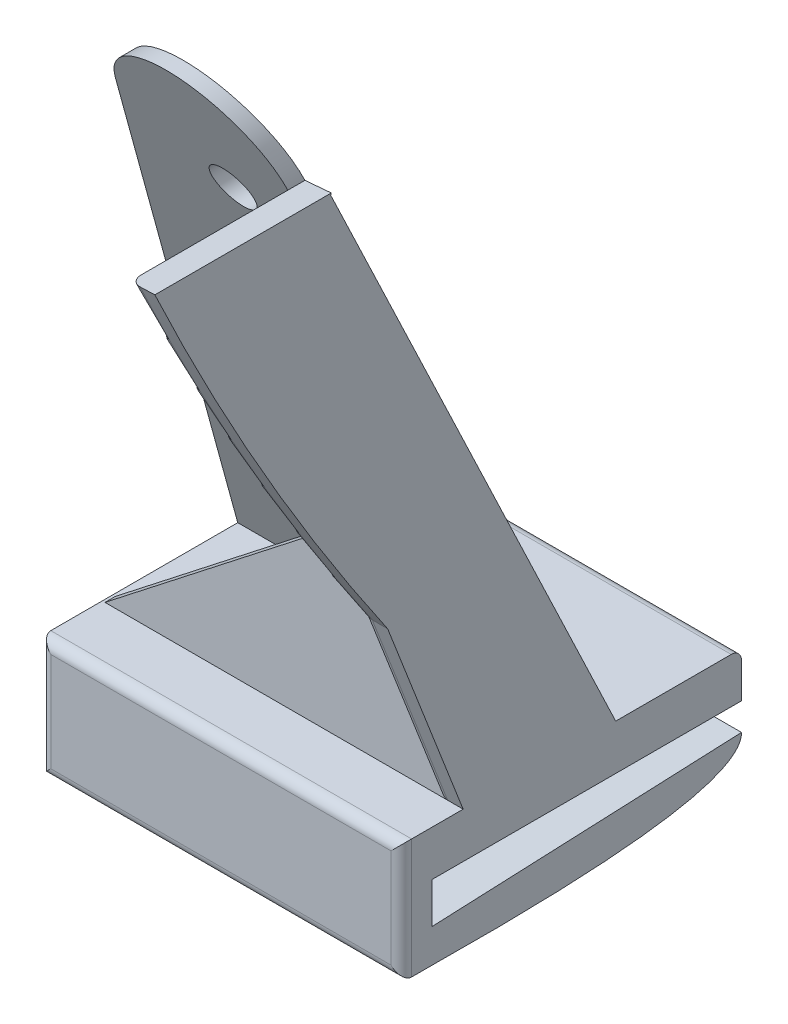
ISO-10303-21;
HEADER;
FILE_DESCRIPTION(('STEP AP214'),'2;1');
FILE_NAME('part.step','',(''),(''),'','','');
FILE_SCHEMA(('AUTOMOTIVE_DESIGN { 1 0 10303 214 1 1 1 1 }'));
ENDSEC;
DATA;
#1=APPLICATION_CONTEXT('core data for automotive mechanical design processes');
#2=APPLICATION_PROTOCOL_DEFINITION('international standard','automotive_design',2000,#1);
#3=PRODUCT_CONTEXT('',#1,'mechanical');
#4=PRODUCT('Part','Part','',(#3));
#5=PRODUCT_RELATED_PRODUCT_CATEGORY('part','',(#4));
#6=PRODUCT_DEFINITION_FORMATION('','',#4);
#7=PRODUCT_DEFINITION_CONTEXT('part definition',#1,'design');
#8=PRODUCT_DEFINITION('design','',#6,#7);
#9=PRODUCT_DEFINITION_SHAPE('','',#8);
#10=(LENGTH_UNIT() NAMED_UNIT(*) SI_UNIT(.MILLI.,.METRE.));
#11=(NAMED_UNIT(*) PLANE_ANGLE_UNIT() SI_UNIT($,.RADIAN.));
#12=(NAMED_UNIT(*) SI_UNIT($,.STERADIAN.) SOLID_ANGLE_UNIT());
#13=UNCERTAINTY_MEASURE_WITH_UNIT(LENGTH_MEASURE(1.E-05),#10,'distance_accuracy_value','');
#14=(GEOMETRIC_REPRESENTATION_CONTEXT(3) GLOBAL_UNCERTAINTY_ASSIGNED_CONTEXT((#13)) GLOBAL_UNIT_ASSIGNED_CONTEXT((#10,
#11,#12)) REPRESENTATION_CONTEXT('',''));
#15=CARTESIAN_POINT('',(0.,0.,0.));
#16=DIRECTION('',(0.,0.,1.));
#17=DIRECTION('',(1.,0.,0.));
#18=AXIS2_PLACEMENT_3D('',#15,#16,#17);
#19=CARTESIAN_POINT('',(35.,12.,3.));
#20=DIRECTION('',(-1.,0.,0.));
#21=DIRECTION('',(0.,0.,1.));
#22=AXIS2_PLACEMENT_3D('',#19,#20,#21);
#23=PLANE('',#22);
#24=DIRECTION('',(0.,1.,0.));
#25=VECTOR('',#24,1.);
#26=CARTESIAN_POINT('',(35.,12.,-30.));
#27=LINE('',#26,#25);
#28=CARTESIAN_POINT('',(35.,7.2,-30.));
#29=VERTEX_POINT('',#28);
#30=CARTESIAN_POINT('',(35.,10.6,-30.));
#31=VERTEX_POINT('',#30);
#32=EDGE_CURVE('E514',#29,#31,#27,.T.);
#33=ORIENTED_EDGE('',*,*,#32,.T.);
#34=CARTESIAN_POINT('',(35.,10.6,-29.));
#35=DIRECTION('',(-1.,0.,0.));
#36=DIRECTION('',(0.,0.,1.));
#37=AXIS2_PLACEMENT_3D('',#34,#35,#36);
#38=CIRCLE('',#37,1.);
#39=CARTESIAN_POINT('',(35.,11.6,-29.));
#40=VERTEX_POINT('',#39);
#41=EDGE_CURVE('E58',#31,#40,#38,.F.);
#42=ORIENTED_EDGE('',*,*,#41,.T.);
#43=DIRECTION('',(0.,0.,1.));
#44=VECTOR('',#43,1.);
#45=CARTESIAN_POINT('',(35.,11.6,3.));
#46=LINE('',#45,#44);
#47=CARTESIAN_POINT('',(35.,11.6,-17.7987012207227));
#48=VERTEX_POINT('',#47);
#49=EDGE_CURVE('E222',#40,#48,#46,.T.);
#50=ORIENTED_EDGE('',*,*,#49,.T.);
#51=DIRECTION('',(0.,-0.902694313973757,-0.430282436917251));
#52=VECTOR('',#51,1.);
#53=CARTESIAN_POINT('',(35.,20.0044393379013,-13.7926023860949));
#54=LINE('',#53,#52);
#55=CARTESIAN_POINT('',(35.,69.5995035208979,9.84760974926995));
#56=VERTEX_POINT('',#55);
#57=EDGE_CURVE('E497',#56,#48,#54,.T.);
#58=ORIENTED_EDGE('',*,*,#57,.F.);
#59=DIRECTION('',(0.,-0.94274645692126,0.333510296636267));
#60=VECTOR('',#59,1.);
#61=CARTESIAN_POINT('',(35.,20.5597376453932,27.1961415247425));
#62=LINE('',#61,#60);
#63=CARTESIAN_POINT('',(35.0000000000001,69.7618447677817,9.7901791675828));
#64=VERTEX_POINT('',#63);
#65=EDGE_CURVE('E275',#64,#56,#62,.T.);
#66=ORIENTED_EDGE('',*,*,#65,.F.);
#67=DIRECTION('',(0.,0.,1.));
#68=VECTOR('',#67,1.);
#69=CARTESIAN_POINT('',(35.,69.7618447677817,3.));
#70=LINE('',#69,#68);
#71=CARTESIAN_POINT('',(35.0000000000001,69.7618447677817,26.902975673547));
#72=VERTEX_POINT('',#71);
#73=EDGE_CURVE('E403',#64,#72,#70,.T.);
#74=ORIENTED_EDGE('',*,*,#73,.T.);
#75=CARTESIAN_POINT('',(35.,186.497951372783,-222.090360411389));
#76=DIRECTION('',(-1.,0.,0.));
#77=DIRECTION('',(0.,0.,-1.));
#78=AXIS2_PLACEMENT_3D('',#75,#76,#77);
#79=CIRCLE('',#78,275.);
#80=CARTESIAN_POINT('',(35.,30.4120068557558,4.32116297959823));
#81=VERTEX_POINT('',#80);
#82=EDGE_CURVE('E378',#81,#72,#79,.T.);
#83=ORIENTED_EDGE('',*,*,#82,.F.);
#84=DIRECTION('',(0.,-0.931914570803609,-0.362677863570311));
#85=VECTOR('',#84,1.);
#86=CARTESIAN_POINT('',(35.,13.975294620325,-2.07559468942881));
#87=LINE('',#86,#85);
#88=CARTESIAN_POINT('',(35.,11.6,-3.));
#89=VERTEX_POINT('',#88);
#90=EDGE_CURVE('E376',#81,#89,#87,.T.);
#91=ORIENTED_EDGE('',*,*,#90,.T.);
#92=DIRECTION('',(0.,0.,1.));
#93=VECTOR('',#92,1.);
#94=CARTESIAN_POINT('',(35.,11.6,3.));
#95=LINE('',#94,#93);
#96=CARTESIAN_POINT('',(35.,11.6,2.));
#97=VERTEX_POINT('',#96);
#98=EDGE_CURVE('E469',#89,#97,#95,.T.);
#99=ORIENTED_EDGE('',*,*,#98,.T.);
#100=DIRECTION('',(0.,1.,0.));
#101=VECTOR('',#100,1.);
#102=CARTESIAN_POINT('',(35.,12.,2.));
#103=LINE('',#102,#101);
#104=CARTESIAN_POINT('',(35.,0.,2.));
#105=VERTEX_POINT('',#104);
#106=EDGE_CURVE('E331',#97,#105,#103,.F.);
#107=ORIENTED_EDGE('',*,*,#106,.T.);
#108=DIRECTION('',(0.,0.,-1.));
#109=VECTOR('',#108,1.);
#110=CARTESIAN_POINT('',(35.,0.,3.));
#111=LINE('',#110,#109);
#112=CARTESIAN_POINT('',(35.,0.,0.));
#113=VERTEX_POINT('',#112);
#114=EDGE_CURVE('E224',#105,#113,#111,.T.);
#115=ORIENTED_EDGE('',*,*,#114,.T.);
#116=CARTESIAN_POINT('',(35.,0.,0.));
#117=CARTESIAN_POINT('',(35.,-0.376378600084011,-30.0529531093992));
#118=CARTESIAN_POINT('',(35.,4.55,-30.));
#119=B_SPLINE_CURVE_WITH_KNOTS('',2,(#116,#117,#118),.UNSPECIFIED.,.F.,.F.,(3,3),(0.,1.),.UNSPECIFIED.);
#120=CARTESIAN_POINT('',(35.,4.55,-30.));
#121=VERTEX_POINT('',#120);
#122=EDGE_CURVE('E200',#113,#121,#119,.T.);
#123=ORIENTED_EDGE('',*,*,#122,.T.);
#124=DIRECTION('',(0.,-0.0432927053569365,0.999062431313918));
#125=VECTOR('',#124,1.);
#126=CARTESIAN_POINT('',(35.,3.25,0.));
#127=LINE('',#126,#125);
#128=CARTESIAN_POINT('',(35.,3.25,0.));
#129=VERTEX_POINT('',#128);
#130=EDGE_CURVE('E247',#121,#129,#127,.T.);
#131=ORIENTED_EDGE('',*,*,#130,.T.);
#132=DIRECTION('',(0.,1.,0.));
#133=VECTOR('',#132,1.);
#134=CARTESIAN_POINT('',(35.,12.,0.));
#135=LINE('',#134,#133);
#136=CARTESIAN_POINT('',(35.,7.2,0.));
#137=VERTEX_POINT('',#136);
#138=EDGE_CURVE('E831',#129,#137,#135,.T.);
#139=ORIENTED_EDGE('',*,*,#138,.T.);
#140=DIRECTION('',(0.,0.,-1.));
#141=VECTOR('',#140,1.);
#142=CARTESIAN_POINT('',(35.,7.2,0.));
#143=LINE('',#142,#141);
#144=EDGE_CURVE('E237',#137,#29,#143,.T.);
#145=ORIENTED_EDGE('',*,*,#144,.T.);
#146=EDGE_LOOP('',(#33,#42,#50,#58,#66,#74,#83,#91,#99,#107,#115,#123,#131,#139,#145));
#147=FACE_BOUND('',#146,.T.);
#148=ADVANCED_FACE('F36',(#147),#23,.F.);
#149=CARTESIAN_POINT('',(32.5,69.5995035208979,0.));
#150=DIRECTION('',(0.0648000197714473,-0.997898270084491,0.));
#151=DIRECTION('',(0.997898270084491,0.0648000197714473,0.));
#152=AXIS2_PLACEMENT_3D('',#149,#150,#151);
#153=PLANE('',#152);
#154=DIRECTION('',(0.997636171848008,0.0647830000296407,-0.0229179302645497));
#155=VECTOR('',#154,1.);
#156=CARTESIAN_POINT('',(32.7251533486157,69.6141241910397,9.84243747415803));
#157=LINE('',#156,#155);
#158=CARTESIAN_POINT('',(32.5,69.5995035208979,9.84760974926995));
#159=VERTEX_POINT('',#158);
#160=EDGE_CURVE('E502',#159,#64,#157,.T.);
#161=ORIENTED_EDGE('',*,*,#160,.F.);
#162=DIRECTION('',(0.,0.,1.));
#163=VECTOR('',#162,1.);
#164=CARTESIAN_POINT('',(32.5,69.5995035208979,0.));
#165=LINE('',#164,#163);
#166=CARTESIAN_POINT('',(32.5,69.5995035208979,11.5093018379205));
#167=VERTEX_POINT('',#166);
#168=EDGE_CURVE('E453',#159,#167,#165,.T.);
#169=ORIENTED_EDGE('',*,*,#168,.T.);
#170=CARTESIAN_POINT('',(32.5,69.5995035208979,25.7215700718309));
#171=VERTEX_POINT('',#170);
#172=EDGE_CURVE('E352',#167,#171,#165,.T.);
#173=ORIENTED_EDGE('',*,*,#172,.T.);
#174=CARTESIAN_POINT('',(32.5,69.5995035208979,25.7215700718309));
#175=CARTESIAN_POINT('',(32.4999809224686,69.5995022820698,25.7900385837331));
#176=CARTESIAN_POINT('',(32.5057509576556,69.5998769679526,25.8585045692338));
#177=CARTESIAN_POINT('',(32.5285812655456,69.6013594882124,25.9936344856225));
#178=CARTESIAN_POINT('',(32.5456600003037,69.6024685214508,26.0602952839014));
#179=CARTESIAN_POINT('',(32.5908378849241,69.6054022150991,26.189838792116));
#180=CARTESIAN_POINT('',(32.6189468233881,69.6072275111466,26.2527180888926));
#181=CARTESIAN_POINT('',(32.6856717817598,69.6115603963227,26.3725816654304));
#182=CARTESIAN_POINT('',(32.7242800770288,69.6140674838404,26.4295702367705));
#183=CARTESIAN_POINT('',(32.8096209692292,69.6196092225803,26.5335702053055));
#184=CARTESIAN_POINT('',(32.8559968101591,69.6226207073171,26.5808744656594));
#185=CARTESIAN_POINT('',(32.9567550235203,69.6291635929134,26.6660607935826));
#186=CARTESIAN_POINT('',(33.0111367945895,69.6326949547227,26.7039435682686));
#187=CARTESIAN_POINT('',(33.1209388566987,69.6398251161919,26.7652912220209));
#188=CARTESIAN_POINT('',(33.1757985495179,69.6433875125663,26.7897651082781));
#189=CARTESIAN_POINT('',(33.2890606899914,69.65074235941,26.8279381357866));
#190=CARTESIAN_POINT('',(33.3474527574135,69.6545341358234,26.8416673384864));
#191=CARTESIAN_POINT('',(33.4220285328634,69.6593768255729,26.8516826110144));
#192=CARTESIAN_POINT('',(33.4375915517591,69.66038743353,26.8533662599938));
#193=CARTESIAN_POINT('',(33.468763205642,69.6624116115935,26.8559285792759));
#194=CARTESIAN_POINT('',(33.4843717557904,69.6634251761908,26.8568082860898));
#195=CARTESIAN_POINT('',(33.5,69.6644400196514,26.8572859420115));
#196=B_SPLINE_CURVE_WITH_KNOTS('',3,(#174,#175,#176,#177,#178,#179,#180,#181,#182,#183,#184,
#185,#186,#187,#188,#189,#190,#191,#192,#193,#194,#195),.UNSPECIFIED.,.F.,.F.,(4,2,2,2,2,2,2,2,
2,2,4),(0.,0.205165865480211,0.410667503724113,0.61635192549021,0.821885427599768,
1.01975245137075,1.21760462002066,1.39716917414618,1.57622952893574,1.62327551534842,
1.67026076010732),.UNSPECIFIED.);
#197=CARTESIAN_POINT('',(33.4999999999994,69.6644400196514,26.8572859420116));
#198=VERTEX_POINT('',#197);
#199=EDGE_CURVE('E256',#171,#198,#196,.T.);
#200=ORIENTED_EDGE('',*,*,#199,.T.);
#201=CARTESIAN_POINT('',(1832.6963471369,186.497951372783,-222.090360411389));
#202=DIRECTION('',(0.0648000197714473,-0.997898270084491,0.));
#203=DIRECTION('',(0.997898270084491,0.0648000197714473,0.));
#204=AXIS2_PLACEMENT_3D('',#201,#202,#203);
#205=ELLIPSE('',#204,4243.8258656392,275.);
#206=EDGE_CURVE('E367',#72,#198,#205,.T.);
#207=ORIENTED_EDGE('',*,*,#206,.F.);
#208=ORIENTED_EDGE('',*,*,#73,.F.);
#209=EDGE_LOOP('',(#161,#169,#173,#200,#207,#208));
#210=FACE_BOUND('',#209,.T.);
#211=ADVANCED_FACE('F294',(#210),#153,.F.);
#212=CARTESIAN_POINT('',(0.,0.,3.));
#213=DIRECTION('',(0.,0.,-1.));
#214=DIRECTION('',(-1.,0.,0.));
#215=AXIS2_PLACEMENT_3D('',#212,#213,#214);
#216=PLANE('',#215);
#217=DIRECTION('',(-1.,0.,0.));
#218=VECTOR('',#217,1.);
#219=CARTESIAN_POINT('',(0.,10.6,3.));
#220=LINE('',#219,#218);
#221=CARTESIAN_POINT('',(34.,10.6,3.));
#222=VERTEX_POINT('',#221);
#223=CARTESIAN_POINT('',(1.,10.6,3.));
#224=VERTEX_POINT('',#223);
#225=EDGE_CURVE('E416',#222,#224,#220,.T.);
#226=ORIENTED_EDGE('',*,*,#225,.T.);
#227=DIRECTION('',(0.,-1.,0.));
#228=VECTOR('',#227,1.);
#229=CARTESIAN_POINT('',(1.,0.,3.));
#230=LINE('',#229,#228);
#231=CARTESIAN_POINT('',(1.,1.,3.));
#232=VERTEX_POINT('',#231);
#233=EDGE_CURVE('E343',#224,#232,#230,.T.);
#234=ORIENTED_EDGE('',*,*,#233,.T.);
#235=DIRECTION('',(1.,0.,0.));
#236=VECTOR('',#235,1.);
#237=CARTESIAN_POINT('',(0.,1.,3.));
#238=LINE('',#237,#236);
#239=CARTESIAN_POINT('',(34.,1.,3.));
#240=VERTEX_POINT('',#239);
#241=EDGE_CURVE('E419',#232,#240,#238,.T.);
#242=ORIENTED_EDGE('',*,*,#241,.T.);
#243=DIRECTION('',(0.,1.,0.));
#244=VECTOR('',#243,1.);
#245=CARTESIAN_POINT('',(34.,0.,3.));
#246=LINE('',#245,#244);
#247=EDGE_CURVE('E333',#240,#222,#246,.T.);
#248=ORIENTED_EDGE('',*,*,#247,.T.);
#249=EDGE_LOOP('',(#226,#234,#242,#248));
#250=FACE_BOUND('',#249,.T.);
#251=ADVANCED_FACE('F299',(#250),#216,.F.);
#252=CARTESIAN_POINT('',(0.,11.6,0.));
#253=DIRECTION('',(0.,1.,0.));
#254=DIRECTION('',(0.,0.,1.));
#255=AXIS2_PLACEMENT_3D('',#252,#253,#254);
#256=PLANE('',#255);
#257=DIRECTION('',(0.,0.,1.));
#258=VECTOR('',#257,1.);
#259=CARTESIAN_POINT('',(0.,11.6,0.));
#260=LINE('',#259,#258);
#261=CARTESIAN_POINT('',(0.,11.6,-16.1370091320722));
#262=VERTEX_POINT('',#261);
#263=CARTESIAN_POINT('',(0.,11.6,2.));
#264=VERTEX_POINT('',#263);
#265=EDGE_CURVE('E429',#262,#264,#260,.T.);
#266=ORIENTED_EDGE('',*,*,#265,.T.);
#267=DIRECTION('',(-1.,0.,0.));
#268=VECTOR('',#267,1.);
#269=CARTESIAN_POINT('',(35.,11.6,2.));
#270=LINE('',#269,#268);
#271=EDGE_CURVE('E341',#264,#97,#270,.F.);
#272=ORIENTED_EDGE('',*,*,#271,.T.);
#273=ORIENTED_EDGE('',*,*,#98,.F.);
#274=DIRECTION('',(-1.,0.,0.));
#275=VECTOR('',#274,1.);
#276=CARTESIAN_POINT('',(42.5,11.6,-3.));
#277=LINE('',#276,#275);
#278=CARTESIAN_POINT('',(33.5,11.6,-3.));
#279=VERTEX_POINT('',#278);
#280=EDGE_CURVE('E466',#89,#279,#277,.T.);
#281=ORIENTED_EDGE('',*,*,#280,.T.);
#282=DIRECTION('',(1.,0.,0.));
#283=VECTOR('',#282,1.);
#284=CARTESIAN_POINT('',(0.,11.6,-3.));
#285=LINE('',#284,#283);
#286=CARTESIAN_POINT('',(0.256151202890215,11.6,-3.));
#287=VERTEX_POINT('',#286);
#288=EDGE_CURVE('E477',#287,#279,#285,.T.);
#289=ORIENTED_EDGE('',*,*,#288,.F.);
#290=DIRECTION('',(0.,0.,1.));
#291=VECTOR('',#290,1.);
#292=CARTESIAN_POINT('',(0.256151202890223,11.6,0.));
#293=LINE('',#292,#291);
#294=CARTESIAN_POINT('',(0.256151202890223,11.6,-4.));
#295=VERTEX_POINT('',#294);
#296=EDGE_CURVE('E481',#295,#287,#293,.T.);
#297=ORIENTED_EDGE('',*,*,#296,.F.);
#298=DIRECTION('',(1.,0.,0.));
#299=VECTOR('',#298,1.);
#300=CARTESIAN_POINT('',(0.,11.6,-4.));
#301=LINE('',#300,#299);
#302=CARTESIAN_POINT('',(32.5,11.6,-4.));
#303=VERTEX_POINT('',#302);
#304=EDGE_CURVE('E479',#295,#303,#301,.T.);
#305=ORIENTED_EDGE('',*,*,#304,.T.);
#306=DIRECTION('',(0.,0.,1.));
#307=VECTOR('',#306,1.);
#308=CARTESIAN_POINT('',(32.5,11.6,0.));
#309=LINE('',#308,#307);
#310=CARTESIAN_POINT('',(32.5,11.6,-16.1370091320722));
#311=VERTEX_POINT('',#310);
#312=EDGE_CURVE('E379',#311,#303,#309,.T.);
#313=ORIENTED_EDGE('',*,*,#312,.F.);
#314=DIRECTION('',(-1.,0.,0.));
#315=VECTOR('',#314,1.);
#316=CARTESIAN_POINT('',(0.,11.6,-16.1370091320722));
#317=LINE('',#316,#315);
#318=EDGE_CURVE('E206',#311,#262,#317,.T.);
#319=ORIENTED_EDGE('',*,*,#318,.T.);
#320=EDGE_LOOP('',(#266,#272,#273,#281,#289,#297,#305,#313,#319));
#321=FACE_BOUND('',#320,.T.);
#322=ADVANCED_FACE('F432',(#321),#256,.T.);
#323=CARTESIAN_POINT('',(32.5,128.,105.));
#324=DIRECTION('',(-1.,0.,0.));
#325=DIRECTION('',(0.,0.,1.));
#326=AXIS2_PLACEMENT_3D('',#323,#324,#325);
#327=PLANE('',#326);
#328=DIRECTION('',(0.,1.,0.));
#329=VECTOR('',#328,1.);
#330=CARTESIAN_POINT('',(32.5,128.,-3.));
#331=LINE('',#330,#329);
#332=CARTESIAN_POINT('',(32.5,14.3572678137995,-3.));
#333=VERTEX_POINT('',#332);
#334=CARTESIAN_POINT('',(32.5,36.7756372277729,-3.));
#335=VERTEX_POINT('',#334);
#336=EDGE_CURVE('E387',#333,#335,#331,.T.);
#337=ORIENTED_EDGE('',*,*,#336,.F.);
#338=DIRECTION('',(0.,-0.931914570803609,-0.362677863570311));
#339=VECTOR('',#338,1.);
#340=CARTESIAN_POINT('',(32.5,30.7746847193261,3.38924840879462));
#341=LINE('',#340,#339);
#342=CARTESIAN_POINT('',(32.5,30.8835778877866,3.43162690885454));
#343=VERTEX_POINT('',#342);
#344=EDGE_CURVE('E357',#333,#343,#341,.F.);
#345=ORIENTED_EDGE('',*,*,#344,.T.);
#346=CARTESIAN_POINT('',(32.5,186.497951372783,-222.090360411389));
#347=DIRECTION('',(-1.,0.,0.));
#348=DIRECTION('',(0.,0.,1.));
#349=AXIS2_PLACEMENT_3D('',#346,#347,#348);
#350=CIRCLE('',#349,274.);
#351=EDGE_CURVE('E355',#343,#171,#350,.T.);
#352=ORIENTED_EDGE('',*,*,#351,.T.);
#353=ORIENTED_EDGE('',*,*,#172,.F.);
#354=DIRECTION('',(0.,0.902694313973756,0.430282436917252));
#355=VECTOR('',#354,1.);
#356=CARTESIAN_POINT('',(32.4999999999999,128.,39.3467519616354));
#357=LINE('',#356,#355);
#358=EDGE_CURVE('E488',#311,#167,#357,.T.);
#359=ORIENTED_EDGE('',*,*,#358,.F.);
#360=ORIENTED_EDGE('',*,*,#312,.T.);
#361=DIRECTION('',(0.,1.,0.));
#362=VECTOR('',#361,1.);
#363=CARTESIAN_POINT('',(32.5,128.,-4.));
#364=LINE('',#363,#362);
#365=CARTESIAN_POINT('',(32.5,36.7756372277729,-4.));
#366=VERTEX_POINT('',#365);
#367=EDGE_CURVE('E392',#303,#366,#364,.T.);
#368=ORIENTED_EDGE('',*,*,#367,.T.);
#369=DIRECTION('',(0.,0.,1.));
#370=VECTOR('',#369,1.);
#371=CARTESIAN_POINT('',(32.5,36.7756372277729,-4.));
#372=LINE('',#371,#370);
#373=EDGE_CURVE('E389',#366,#335,#372,.T.);
#374=ORIENTED_EDGE('',*,*,#373,.T.);
#375=EDGE_LOOP('',(#337,#345,#352,#353,#359,#360,#368,#374));
#376=FACE_BOUND('',#375,.T.);
#377=ADVANCED_FACE('F303',(#376),#327,.T.);
#378=CARTESIAN_POINT('',(0.,0.,3.));
#379=DIRECTION('',(1.,0.,0.));
#380=DIRECTION('',(0.,0.,-1.));
#381=AXIS2_PLACEMENT_3D('',#378,#379,#380);
#382=PLANE('',#381);
#383=DIRECTION('',(0.,0.,1.));
#384=VECTOR('',#383,1.);
#385=CARTESIAN_POINT('',(0.,10.6,-44.));
#386=LINE('',#385,#384);
#387=CARTESIAN_POINT('',(0.,10.6,-18.2753658349298));
#388=VERTEX_POINT('',#387);
#389=CARTESIAN_POINT('',(0.,10.6,-30.));
#390=VERTEX_POINT('',#389);
#391=EDGE_CURVE('E409',#388,#390,#386,.F.);
#392=ORIENTED_EDGE('',*,*,#391,.T.);
#393=DIRECTION('',(0.,1.,0.));
#394=VECTOR('',#393,1.);
#395=CARTESIAN_POINT('',(0.,4.55,-30.));
#396=LINE('',#395,#394);
#397=CARTESIAN_POINT('',(0.,7.2,-30.));
#398=VERTEX_POINT('',#397);
#399=EDGE_CURVE('E217',#398,#390,#396,.T.);
#400=ORIENTED_EDGE('',*,*,#399,.F.);
#401=DIRECTION('',(0.,0.,-1.));
#402=VECTOR('',#401,1.);
#403=CARTESIAN_POINT('',(0.,7.2,0.));
#404=LINE('',#403,#402);
#405=CARTESIAN_POINT('',(0.,7.2,0.));
#406=VERTEX_POINT('',#405);
#407=EDGE_CURVE('E436',#406,#398,#404,.T.);
#408=ORIENTED_EDGE('',*,*,#407,.F.);
#409=DIRECTION('',(0.,-1.,0.));
#410=VECTOR('',#409,1.);
#411=CARTESIAN_POINT('',(0.,0.,0.));
#412=LINE('',#411,#410);
#413=CARTESIAN_POINT('',(0.,3.25,0.));
#414=VERTEX_POINT('',#413);
#415=EDGE_CURVE('E233',#406,#414,#412,.T.);
#416=ORIENTED_EDGE('',*,*,#415,.T.);
#417=DIRECTION('',(0.,-0.0432927053569365,0.999062431313918));
#418=VECTOR('',#417,1.);
#419=CARTESIAN_POINT('',(0.,3.25,0.));
#420=LINE('',#419,#418);
#421=CARTESIAN_POINT('',(0.,4.55,-30.));
#422=VERTEX_POINT('',#421);
#423=EDGE_CURVE('E216',#422,#414,#420,.T.);
#424=ORIENTED_EDGE('',*,*,#423,.F.);
#425=CARTESIAN_POINT('',(0.,0.,0.));
#426=CARTESIAN_POINT('',(0.,-0.376378600084011,-30.0529531093992));
#427=CARTESIAN_POINT('',(0.,4.55,-30.));
#428=B_SPLINE_CURVE_WITH_KNOTS('',2,(#425,#426,#427),.UNSPECIFIED.,.F.,.F.,(3,3),(0.,1.),.UNSPECIFIED.);
#429=CARTESIAN_POINT('',(0.,0.,0.));
#430=VERTEX_POINT('',#429);
#431=EDGE_CURVE('E197',#430,#422,#428,.T.);
#432=ORIENTED_EDGE('',*,*,#431,.F.);
#433=DIRECTION('',(0.,0.,-1.));
#434=VECTOR('',#433,1.);
#435=CARTESIAN_POINT('',(0.,0.,3.));
#436=LINE('',#435,#434);
#437=CARTESIAN_POINT('',(0.,0.,2.));
#438=VERTEX_POINT('',#437);
#439=EDGE_CURVE('E205',#438,#430,#436,.T.);
#440=ORIENTED_EDGE('',*,*,#439,.F.);
#441=DIRECTION('',(0.,-1.,0.));
#442=VECTOR('',#441,1.);
#443=CARTESIAN_POINT('',(0.,0.,2.));
#444=LINE('',#443,#442);
#445=EDGE_CURVE('E339',#438,#264,#444,.F.);
#446=ORIENTED_EDGE('',*,*,#445,.T.);
#447=ORIENTED_EDGE('',*,*,#265,.F.);
#448=DIRECTION('',(0.,0.,-1.));
#449=VECTOR('',#448,1.);
#450=CARTESIAN_POINT('',(0.,11.6,105.));
#451=LINE('',#450,#449);
#452=CARTESIAN_POINT('',(0.,11.6,-17.7987012207227));
#453=VERTEX_POINT('',#452);
#454=EDGE_CURVE('E484',#262,#453,#451,.T.);
#455=ORIENTED_EDGE('',*,*,#454,.T.);
#456=DIRECTION('',(0.,-0.902694313973757,-0.430282436917252));
#457=VECTOR('',#456,1.);
#458=CARTESIAN_POINT('',(0.,10.2261550441347,-18.4535644965906));
#459=LINE('',#458,#457);
#460=EDGE_CURVE('E411',#453,#388,#459,.T.);
#461=ORIENTED_EDGE('',*,*,#460,.T.);
#462=EDGE_LOOP('',(#392,#400,#408,#416,#424,#432,#440,#446,#447,#455,#461));
#463=FACE_BOUND('',#462,.T.);
#464=ADVANCED_FACE('F212',(#463),#382,.F.);
#465=ORIENTED_EDGE('',*,*,#49,.F.);
#466=DIRECTION('',(1.,0.,0.));
#467=VECTOR('',#466,1.);
#468=CARTESIAN_POINT('',(1.,11.6,-29.));
#469=LINE('',#468,#467);
#470=CARTESIAN_POINT('',(1.,11.6,-29.));
#471=VERTEX_POINT('',#470);
#472=EDGE_CURVE('E44',#40,#471,#469,.F.);
#473=ORIENTED_EDGE('',*,*,#472,.T.);
#474=DIRECTION('',(0.,0.,1.));
#475=VECTOR('',#474,1.);
#476=CARTESIAN_POINT('',(1.,11.6,-17.7987012207227));
#477=LINE('',#476,#475);
#478=CARTESIAN_POINT('',(1.,11.6,-17.7987012207227));
#479=VERTEX_POINT('',#478);
#480=EDGE_CURVE('E407',#471,#479,#477,.T.);
#481=ORIENTED_EDGE('',*,*,#480,.T.);
#482=DIRECTION('',(1.,0.,0.));
#483=VECTOR('',#482,1.);
#484=CARTESIAN_POINT('',(-37.5,11.6,-17.7987012207227));
#485=LINE('',#484,#483);
#486=EDGE_CURVE('E489',#479,#48,#485,.T.);
#487=ORIENTED_EDGE('',*,*,#486,.T.);
#488=EDGE_LOOP('',(#465,#473,#481,#487));
#489=FACE_BOUND('',#488,.T.);
#490=ADVANCED_FACE('F493',(#489),#256,.T.);
#491=CARTESIAN_POINT('',(0.,0.,3.));
#492=DIRECTION('',(0.,1.,0.));
#493=DIRECTION('',(0.,0.,1.));
#494=AXIS2_PLACEMENT_3D('',#491,#492,#493);
#495=PLANE('',#494);
#496=ORIENTED_EDGE('',*,*,#114,.F.);
#497=DIRECTION('',(1.,0.,0.));
#498=VECTOR('',#497,1.);
#499=CARTESIAN_POINT('',(0.,0.,2.));
#500=LINE('',#499,#498);
#501=EDGE_CURVE('E221',#105,#438,#500,.F.);
#502=ORIENTED_EDGE('',*,*,#501,.T.);
#503=ORIENTED_EDGE('',*,*,#439,.T.);
#504=DIRECTION('',(1.,0.,0.));
#505=VECTOR('',#504,1.);
#506=CARTESIAN_POINT('',(0.,0.,0.));
#507=LINE('',#506,#505);
#508=EDGE_CURVE('E194',#430,#113,#507,.T.);
#509=ORIENTED_EDGE('',*,*,#508,.T.);
#510=EDGE_LOOP('',(#496,#502,#503,#509));
#511=FACE_BOUND('',#510,.T.);
#512=ADVANCED_FACE('F219',(#511),#495,.F.);
#513=CARTESIAN_POINT('',(0.,0.,0.));
#514=DIRECTION('',(0.,0.,-1.));
#515=DIRECTION('',(-1.,0.,0.));
#516=AXIS2_PLACEMENT_3D('',#513,#514,#515);
#517=PLANE('',#516);
#518=DIRECTION('',(1.,0.,0.));
#519=VECTOR('',#518,1.);
#520=CARTESIAN_POINT('',(0.,7.2,0.));
#521=LINE('',#520,#519);
#522=EDGE_CURVE('E236',#406,#137,#521,.T.);
#523=ORIENTED_EDGE('',*,*,#522,.T.);
#524=ORIENTED_EDGE('',*,*,#138,.F.);
#525=DIRECTION('',(1.,0.,0.));
#526=VECTOR('',#525,1.);
#527=CARTESIAN_POINT('',(0.,3.25,0.));
#528=LINE('',#527,#526);
#529=EDGE_CURVE('E246',#414,#129,#528,.T.);
#530=ORIENTED_EDGE('',*,*,#529,.F.);
#531=ORIENTED_EDGE('',*,*,#415,.F.);
#532=EDGE_LOOP('',(#523,#524,#530,#531));
#533=FACE_BOUND('',#532,.T.);
#534=ADVANCED_FACE('F567',(#533),#517,.T.);
#535=CARTESIAN_POINT('',(0.,3.25,0.));
#536=DIRECTION('',(0.,0.999062431313918,0.0432927053569365));
#537=DIRECTION('',(0.,-0.0432927053569365,0.999062431313918));
#538=AXIS2_PLACEMENT_3D('',#535,#536,#537);
#539=PLANE('',#538);
#540=DIRECTION('',(-1.,0.,0.));
#541=VECTOR('',#540,1.);
#542=CARTESIAN_POINT('',(100.,4.55,-30.));
#543=LINE('',#542,#541);
#544=EDGE_CURVE('E516',#121,#422,#543,.T.);
#545=ORIENTED_EDGE('',*,*,#544,.T.);
#546=ORIENTED_EDGE('',*,*,#423,.T.);
#547=ORIENTED_EDGE('',*,*,#529,.T.);
#548=ORIENTED_EDGE('',*,*,#130,.F.);
#549=EDGE_LOOP('',(#545,#546,#547,#548));
#550=FACE_BOUND('',#549,.T.);
#551=ADVANCED_FACE('F572',(#550),#539,.T.);
#552=CARTESIAN_POINT('',(0.,7.2,0.));
#553=DIRECTION('',(0.,-1.,0.));
#554=DIRECTION('',(0.,0.,-1.));
#555=AXIS2_PLACEMENT_3D('',#552,#553,#554);
#556=PLANE('',#555);
#557=DIRECTION('',(-1.,0.,0.));
#558=VECTOR('',#557,1.);
#559=CARTESIAN_POINT('',(0.,7.2,-30.));
#560=LINE('',#559,#558);
#561=EDGE_CURVE('E509',#29,#398,#560,.T.);
#562=ORIENTED_EDGE('',*,*,#561,.F.);
#563=ORIENTED_EDGE('',*,*,#144,.F.);
#564=ORIENTED_EDGE('',*,*,#522,.F.);
#565=ORIENTED_EDGE('',*,*,#407,.T.);
#566=EDGE_LOOP('',(#562,#563,#564,#565));
#567=FACE_BOUND('',#566,.T.);
#568=ADVANCED_FACE('F578',(#567),#556,.T.);
#569=CARTESIAN_POINT('',(-35.,186.497951372783,-222.090360411389));
#570=DIRECTION('',(1.,0.,0.));
#571=DIRECTION('',(0.,0.,-1.));
#572=AXIS2_PLACEMENT_3D('',#569,#570,#571);
#573=CYLINDRICAL_SURFACE('',#572,275.);
#574=ORIENTED_EDGE('',*,*,#206,.T.);
#575=CARTESIAN_POINT('',(33.5,186.497951372783,-222.090360411389));
#576=DIRECTION('',(-1.,0.,0.));
#577=DIRECTION('',(0.,0.,1.));
#578=AXIS2_PLACEMENT_3D('',#575,#576,#577);
#579=CIRCLE('',#578,275.);
#580=CARTESIAN_POINT('',(33.5,30.4120068557558,4.32116297959823));
#581=VERTEX_POINT('',#580);
#582=EDGE_CURVE('E261',#198,#581,#579,.F.);
#583=ORIENTED_EDGE('',*,*,#582,.T.);
#584=DIRECTION('',(1.,0.,0.));
#585=VECTOR('',#584,1.);
#586=CARTESIAN_POINT('',(-35.,30.4120068557558,4.32116297959823));
#587=LINE('',#586,#585);
#588=EDGE_CURVE('E364',#581,#81,#587,.T.);
#589=ORIENTED_EDGE('',*,*,#588,.T.);
#590=ORIENTED_EDGE('',*,*,#82,.T.);
#591=EDGE_LOOP('',(#574,#583,#589,#590));
#592=FACE_BOUND('',#591,.T.);
#593=ADVANCED_FACE('F362',(#592),#573,.T.);
#594=CARTESIAN_POINT('',(-37.5000000000001,128.,39.3467519616354));
#595=DIRECTION('',(0.,0.430282436917252,-0.902694313973756));
#596=DIRECTION('',(0.,0.902694313973756,0.430282436917252));
#597=AXIS2_PLACEMENT_3D('',#594,#595,#596);
#598=PLANE('',#597);
#599=CARTESIAN_POINT('',(25.,65.,9.31688126658744));
#600=DIRECTION('',(0.,0.430282436917252,-0.902694313973756));
#601=DIRECTION('',(0.,0.902694313973756,0.430282436917252));
#602=AXIS2_PLACEMENT_3D('',#599,#600,#601);
#603=ELLIPSE('',#602,2.32636892411073,2.1);
#604=CARTESIAN_POINT('',(25.,67.1,10.3178769564224));
#605=VERTEX_POINT('',#604);
#606=EDGE_CURVE('E402',#605,#605,#603,.T.);
#607=ORIENTED_EDGE('',*,*,#606,.T.);
#608=EDGE_LOOP('',(#607));
#609=FACE_BOUND('',#608,.T.);
#610=ORIENTED_EDGE('',*,*,#358,.T.);
#611=CARTESIAN_POINT('',(24.5,69.5995035208995,11.5093018379212));
#612=DIRECTION('',(0.,0.430282436917252,-0.902694313973756));
#613=DIRECTION('',(0.,0.902694313973756,0.430282436917252));
#614=AXIS2_PLACEMENT_3D('',#611,#612,#613);
#615=ELLIPSE('',#614,8.8623578061361,7.99999999999999);
#616=CARTESIAN_POINT('',(16.794708656675,71.7508950042146,12.5347940293241));
#617=VERTEX_POINT('',#616);
#618=EDGE_CURVE('E449',#167,#617,#615,.F.);
#619=ORIENTED_EDGE('',*,*,#618,.T.);
#620=DIRECTION('',(-0.244397810333895,-0.875320157626628,-0.417234145242803));
#621=VECTOR('',#620,1.);
#622=CARTESIAN_POINT('',(28.3188797212798,113.025156909445,32.2087741570641));
#623=LINE('',#622,#621);
#624=EDGE_CURVE('E486',#617,#262,#623,.T.);
#625=ORIENTED_EDGE('',*,*,#624,.T.);
#626=ORIENTED_EDGE('',*,*,#318,.F.);
#627=EDGE_LOOP('',(#610,#619,#625,#626));
#628=FACE_BOUND('',#627,.T.);
#629=ADVANCED_FACE('F559',(#609,#628),#598,.F.);
#630=CARTESIAN_POINT('',(-37.5000000000001,128.,37.6850598729848));
#631=DIRECTION('',(0.,-0.430282436917252,0.902694313973757));
#632=DIRECTION('',(0.,-0.902694313973757,-0.430282436917252));
#633=AXIS2_PLACEMENT_3D('',#630,#631,#632);
#634=PLANE('',#633);
#635=ORIENTED_EDGE('',*,*,#486,.F.);
#636=CARTESIAN_POINT('',(1.,10.6,-18.2753658349298));
#637=DIRECTION('',(0.,-0.430282436917252,0.902694313973757));
#638=DIRECTION('',(0.,-0.902694313973757,-0.430282436917252));
#639=AXIS2_PLACEMENT_3D('',#636,#637,#638);
#640=ELLIPSE('',#639,1.10779472576701,1.);
#641=EDGE_CURVE('E414',#479,#388,#640,.T.);
#642=ORIENTED_EDGE('',*,*,#641,.T.);
#643=ORIENTED_EDGE('',*,*,#460,.F.);
#644=DIRECTION('',(0.244397810333895,0.875320157626628,0.417234145242803));
#645=VECTOR('',#644,1.);
#646=CARTESIAN_POINT('',(28.3188797212798,113.025156909445,30.5470820684136));
#647=LINE('',#646,#645);
#648=CARTESIAN_POINT('',(16.794708656675,71.7508950042146,10.8731019406735));
#649=VERTEX_POINT('',#648);
#650=EDGE_CURVE('E393',#453,#649,#647,.T.);
#651=ORIENTED_EDGE('',*,*,#650,.T.);
#652=CARTESIAN_POINT('',(24.5,69.5995035208995,9.84760974927068));
#653=DIRECTION('',(0.,-0.430282436917252,0.902694313973757));
#654=DIRECTION('',(0.,0.902694313973757,0.430282436917252));
#655=AXIS2_PLACEMENT_3D('',#652,#653,#654);
#656=ELLIPSE('',#655,8.86235780613609,7.99999999999999);
#657=EDGE_CURVE('E456',#649,#159,#656,.F.);
#658=ORIENTED_EDGE('',*,*,#657,.T.);
#659=DIRECTION('',(1.,0.,0.));
#660=VECTOR('',#659,1.);
#661=CARTESIAN_POINT('',(-107.529096293076,69.5995035208979,9.84760974926995));
#662=LINE('',#661,#660);
#663=EDGE_CURVE('E501',#159,#56,#662,.T.);
#664=ORIENTED_EDGE('',*,*,#663,.T.);
#665=ORIENTED_EDGE('',*,*,#57,.T.);
#666=EDGE_LOOP('',(#635,#642,#643,#651,#658,#664,#665));
#667=FACE_BOUND('',#666,.T.);
#668=CARTESIAN_POINT('',(25.,65.,7.6551891779369));
#669=DIRECTION('',(0.,-0.430282436917252,0.902694313973757));
#670=DIRECTION('',(0.,0.902694313973757,0.430282436917252));
#671=AXIS2_PLACEMENT_3D('',#668,#669,#670);
#672=ELLIPSE('',#671,2.32636892411073,2.1);
#673=CARTESIAN_POINT('',(25.,67.1,8.65618486777183));
#674=VERTEX_POINT('',#673);
#675=EDGE_CURVE('E399',#674,#674,#672,.T.);
#676=ORIENTED_EDGE('',*,*,#675,.T.);
#677=EDGE_LOOP('',(#676));
#678=FACE_BOUND('',#677,.T.);
#679=ADVANCED_FACE('F498',(#667,#678),#634,.F.);
#680=CARTESIAN_POINT('',(32.4999999999999,128.,105.));
#681=DIRECTION('',(0.963161417915574,-0.268923935414571,0.));
#682=DIRECTION('',(0.268923935414571,0.963161417915574,0.));
#683=AXIS2_PLACEMENT_3D('',#680,#681,#682);
#684=PLANE('',#683);
#685=ORIENTED_EDGE('',*,*,#624,.F.);
#686=DIRECTION('',(0.,0.,-1.));
#687=VECTOR('',#686,1.);
#688=CARTESIAN_POINT('',(16.794708656675,71.7508950042146,105.));
#689=LINE('',#688,#687);
#690=EDGE_CURVE('E395',#617,#649,#689,.T.);
#691=ORIENTED_EDGE('',*,*,#690,.T.);
#692=ORIENTED_EDGE('',*,*,#650,.F.);
#693=ORIENTED_EDGE('',*,*,#454,.F.);
#694=EDGE_LOOP('',(#685,#691,#692,#693));
#695=FACE_BOUND('',#694,.T.);
#696=ADVANCED_FACE('F554',(#695),#684,.F.);
#697=CARTESIAN_POINT('',(32.5,36.7756372277729,-4.));
#698=DIRECTION('',(-0.615418296825304,0.788200685062277,0.));
#699=DIRECTION('',(-0.788200685062277,-0.615418296825304,0.));
#700=AXIS2_PLACEMENT_3D('',#697,#698,#699);
#701=PLANE('',#700);
#702=DIRECTION('',(-0.788200685062277,-0.615418296825304,0.));
#703=VECTOR('',#702,1.);
#704=CARTESIAN_POINT('',(32.5,36.7756372277729,-4.));
#705=LINE('',#704,#703);
#706=EDGE_CURVE('E472',#366,#295,#705,.T.);
#707=ORIENTED_EDGE('',*,*,#706,.T.);
#708=ORIENTED_EDGE('',*,*,#296,.T.);
#709=DIRECTION('',(-0.788200685062277,-0.615418296825304,0.));
#710=VECTOR('',#709,1.);
#711=CARTESIAN_POINT('',(32.5,36.7756372277729,-3.));
#712=LINE('',#711,#710);
#713=EDGE_CURVE('E471',#335,#287,#712,.T.);
#714=ORIENTED_EDGE('',*,*,#713,.F.);
#715=ORIENTED_EDGE('',*,*,#373,.F.);
#716=EDGE_LOOP('',(#707,#708,#714,#715));
#717=FACE_BOUND('',#716,.T.);
#718=ADVANCED_FACE('F548',(#717),#701,.T.);
#719=CARTESIAN_POINT('',(0.,0.,-4.));
#720=DIRECTION('',(0.,0.,1.));
#721=DIRECTION('',(1.,0.,0.));
#722=AXIS2_PLACEMENT_3D('',#719,#720,#721);
#723=PLANE('',#722);
#724=ORIENTED_EDGE('',*,*,#304,.F.);
#725=ORIENTED_EDGE('',*,*,#706,.F.);
#726=ORIENTED_EDGE('',*,*,#367,.F.);
#727=EDGE_LOOP('',(#724,#725,#726));
#728=FACE_BOUND('',#727,.T.);
#729=ADVANCED_FACE('F545',(#728),#723,.F.);
#730=CARTESIAN_POINT('',(0.,0.,-3.));
#731=DIRECTION('',(0.,0.,1.));
#732=DIRECTION('',(1.,0.,0.));
#733=AXIS2_PLACEMENT_3D('',#730,#731,#732);
#734=PLANE('',#733);
#735=ORIENTED_EDGE('',*,*,#713,.T.);
#736=ORIENTED_EDGE('',*,*,#288,.T.);
#737=CARTESIAN_POINT('',(33.5,14.3572678137995,-3.));
#738=DIRECTION('',(0.,0.,1.));
#739=DIRECTION('',(0.,1.,0.));
#740=AXIS2_PLACEMENT_3D('',#737,#738,#739);
#741=ELLIPSE('',#740,2.75726781379954,1.);
#742=EDGE_CURVE('E252',#279,#333,#741,.F.);
#743=ORIENTED_EDGE('',*,*,#742,.T.);
#744=ORIENTED_EDGE('',*,*,#336,.T.);
#745=EDGE_LOOP('',(#735,#736,#743,#744));
#746=FACE_BOUND('',#745,.T.);
#747=ADVANCED_FACE('F544',(#746),#734,.T.);
#748=CARTESIAN_POINT('',(42.5,11.6,-3.));
#749=DIRECTION('',(0.,0.362677863570311,-0.931914570803609));
#750=DIRECTION('',(0.,0.931914570803609,0.362677863570311));
#751=AXIS2_PLACEMENT_3D('',#748,#749,#750);
#752=PLANE('',#751);
#753=ORIENTED_EDGE('',*,*,#588,.F.);
#754=DIRECTION('',(0.,-0.931914570803609,-0.362677863570311));
#755=VECTOR('',#754,1.);
#756=CARTESIAN_POINT('',(33.5,11.6,-3.));
#757=LINE('',#756,#755);
#758=EDGE_CURVE('E348',#581,#279,#757,.T.);
#759=ORIENTED_EDGE('',*,*,#758,.T.);
#760=ORIENTED_EDGE('',*,*,#280,.F.);
#761=ORIENTED_EDGE('',*,*,#90,.F.);
#762=EDGE_LOOP('',(#753,#759,#760,#761));
#763=FACE_BOUND('',#762,.T.);
#764=ADVANCED_FACE('F371',(#763),#752,.F.);
#765=CARTESIAN_POINT('',(25.,65.,0.));
#766=DIRECTION('',(0.,0.,1.));
#767=DIRECTION('',(1.,0.,0.));
#768=AXIS2_PLACEMENT_3D('',#765,#766,#767);
#769=CYLINDRICAL_SURFACE('',#768,2.1);
#770=ORIENTED_EDGE('',*,*,#675,.F.);
#771=EDGE_LOOP('',(#770));
#772=FACE_BOUND('',#771,.T.);
#773=ORIENTED_EDGE('',*,*,#606,.F.);
#774=EDGE_LOOP('',(#773));
#775=FACE_BOUND('',#774,.T.);
#776=ADVANCED_FACE('F537',(#772,#775),#769,.F.);
#777=CARTESIAN_POINT('',(24.5,69.5995035208995,0.));
#778=DIRECTION('',(0.,0.,1.));
#779=DIRECTION('',(1.,0.,0.));
#780=AXIS2_PLACEMENT_3D('',#777,#778,#779);
#781=CYLINDRICAL_SURFACE('',#780,7.99999999999999);
#782=ORIENTED_EDGE('',*,*,#168,.F.);
#783=ORIENTED_EDGE('',*,*,#657,.F.);
#784=ORIENTED_EDGE('',*,*,#690,.F.);
#785=ORIENTED_EDGE('',*,*,#618,.F.);
#786=EDGE_LOOP('',(#782,#783,#784,#785));
#787=FACE_BOUND('',#786,.T.);
#788=ADVANCED_FACE('F309',(#787),#781,.T.);
#789=CARTESIAN_POINT('',(1.,10.6,0.));
#790=DIRECTION('',(0.,0.,-1.));
#791=DIRECTION('',(-1.,0.,0.));
#792=AXIS2_PLACEMENT_3D('',#789,#790,#791);
#793=CYLINDRICAL_SURFACE('',#792,1.);
#794=ORIENTED_EDGE('',*,*,#480,.F.);
#795=CARTESIAN_POINT('',(1.,10.6,-29.));
#796=DIRECTION('',(0.707106781186547,0.,-0.707106781186547));
#797=DIRECTION('',(-0.707106781186547,0.,-0.707106781186547));
#798=AXIS2_PLACEMENT_3D('',#795,#796,#797);
#799=ELLIPSE('',#798,1.41421356237309,1.);
#800=EDGE_CURVE('E11',#471,#390,#799,.F.);
#801=ORIENTED_EDGE('',*,*,#800,.T.);
#802=ORIENTED_EDGE('',*,*,#391,.F.);
#803=ORIENTED_EDGE('',*,*,#641,.F.);
#804=EDGE_LOOP('',(#794,#801,#802,#803));
#805=FACE_BOUND('',#804,.T.);
#806=ADVANCED_FACE('F305',(#805),#793,.T.);
#807=CARTESIAN_POINT('',(34.,0.,2.));
#808=DIRECTION('',(0.,1.,0.));
#809=DIRECTION('',(0.,0.,1.));
#810=AXIS2_PLACEMENT_3D('',#807,#808,#809);
#811=CYLINDRICAL_SURFACE('',#810,1.);
#812=CARTESIAN_POINT('',(34.,1.,2.));
#813=DIRECTION('',(0.707106781186547,0.707106781186547,0.));
#814=DIRECTION('',(-0.707106781186547,0.707106781186547,0.));
#815=AXIS2_PLACEMENT_3D('',#812,#813,#814);
#816=ELLIPSE('',#815,1.41421356237309,1.);
#817=EDGE_CURVE('E329',#105,#240,#816,.F.);
#818=ORIENTED_EDGE('',*,*,#817,.F.);
#819=ORIENTED_EDGE('',*,*,#106,.F.);
#820=CARTESIAN_POINT('',(34.,10.6,2.));
#821=DIRECTION('',(0.707106781186547,-0.707106781186547,0.));
#822=DIRECTION('',(0.707106781186547,0.707106781186547,0.));
#823=AXIS2_PLACEMENT_3D('',#820,#821,#822);
#824=ELLIPSE('',#823,1.41421356237309,1.);
#825=EDGE_CURVE('E335',#222,#97,#824,.F.);
#826=ORIENTED_EDGE('',*,*,#825,.F.);
#827=ORIENTED_EDGE('',*,*,#247,.F.);
#828=EDGE_LOOP('',(#818,#819,#826,#827));
#829=FACE_BOUND('',#828,.T.);
#830=ADVANCED_FACE('F308',(#829),#811,.T.);
#831=CARTESIAN_POINT('',(0.,10.6,2.));
#832=DIRECTION('',(1.,0.,0.));
#833=DIRECTION('',(0.,0.,-1.));
#834=AXIS2_PLACEMENT_3D('',#831,#832,#833);
#835=CYLINDRICAL_SURFACE('',#834,1.);
#836=ORIENTED_EDGE('',*,*,#825,.T.);
#837=ORIENTED_EDGE('',*,*,#271,.F.);
#838=CARTESIAN_POINT('',(1.,10.6,2.));
#839=DIRECTION('',(0.707106781186547,0.707106781186547,0.));
#840=DIRECTION('',(0.707106781186547,-0.707106781186547,0.));
#841=AXIS2_PLACEMENT_3D('',#838,#839,#840);
#842=ELLIPSE('',#841,1.41421356237309,1.);
#843=EDGE_CURVE('E336',#224,#264,#842,.F.);
#844=ORIENTED_EDGE('',*,*,#843,.F.);
#845=ORIENTED_EDGE('',*,*,#225,.F.);
#846=EDGE_LOOP('',(#836,#837,#844,#845));
#847=FACE_BOUND('',#846,.T.);
#848=ADVANCED_FACE('F317',(#847),#835,.T.);
#849=CARTESIAN_POINT('',(0.,1.,2.));
#850=DIRECTION('',(1.,0.,0.));
#851=DIRECTION('',(0.,0.,-1.));
#852=AXIS2_PLACEMENT_3D('',#849,#850,#851);
#853=CYLINDRICAL_SURFACE('',#852,1.);
#854=ORIENTED_EDGE('',*,*,#817,.T.);
#855=ORIENTED_EDGE('',*,*,#241,.F.);
#856=CARTESIAN_POINT('',(1.,1.,2.));
#857=DIRECTION('',(0.707106781186547,-0.707106781186547,0.));
#858=DIRECTION('',(0.707106781186547,0.707106781186547,0.));
#859=AXIS2_PLACEMENT_3D('',#856,#857,#858);
#860=ELLIPSE('',#859,1.41421356237309,1.);
#861=EDGE_CURVE('E274',#438,#232,#860,.F.);
#862=ORIENTED_EDGE('',*,*,#861,.F.);
#863=ORIENTED_EDGE('',*,*,#501,.F.);
#864=EDGE_LOOP('',(#854,#855,#862,#863));
#865=FACE_BOUND('',#864,.T.);
#866=ADVANCED_FACE('F313',(#865),#853,.T.);
#867=CARTESIAN_POINT('',(1.,0.,2.));
#868=DIRECTION('',(0.,-1.,0.));
#869=DIRECTION('',(0.,0.,-1.));
#870=AXIS2_PLACEMENT_3D('',#867,#868,#869);
#871=CYLINDRICAL_SURFACE('',#870,1.);
#872=ORIENTED_EDGE('',*,*,#843,.T.);
#873=ORIENTED_EDGE('',*,*,#445,.F.);
#874=ORIENTED_EDGE('',*,*,#861,.T.);
#875=ORIENTED_EDGE('',*,*,#233,.F.);
#876=EDGE_LOOP('',(#872,#873,#874,#875));
#877=FACE_BOUND('',#876,.T.);
#878=ADVANCED_FACE('F291',(#877),#871,.T.);
#879=CARTESIAN_POINT('',(33.5,186.497951372783,-222.090360411389));
#880=DIRECTION('',(-1.,0.,0.));
#881=DIRECTION('',(0.,0.,1.));
#882=AXIS2_PLACEMENT_3D('',#879,#880,#881);
#883=TOROIDAL_SURFACE('',#882,274.,1.);
#884=ORIENTED_EDGE('',*,*,#199,.F.);
#885=ORIENTED_EDGE('',*,*,#351,.F.);
#886=CARTESIAN_POINT('',(33.5,30.4120068557558,4.32116297959823));
#887=CARTESIAN_POINT('',(33.4720041040842,30.4120068977515,4.32116290343598));
#888=CARTESIAN_POINT('',(33.4440216691523,30.4125614943542,4.32011648193836));
#889=CARTESIAN_POINT('',(33.3882580807912,30.4147736962152,4.31594248498056));
#890=CARTESIAN_POINT('',(33.360476915129,30.4164312338594,4.31281503709458));
#891=CARTESIAN_POINT('',(33.2777894973574,30.4230413905395,4.30034301926954));
#892=CARTESIAN_POINT('',(33.2234388585921,30.4296316033723,4.28790868055551));
#893=CARTESIAN_POINT('',(33.117876231069,30.4469889100129,4.25515969033565));
#894=CARTESIAN_POINT('',(33.066665539734,30.4577577171209,4.23484180643218));
#895=CARTESIAN_POINT('',(32.9688183771847,30.4831562385765,4.18692268697523));
#896=CARTESIAN_POINT('',(32.9221810860727,30.4977852591411,4.1593227601986));
#897=CARTESIAN_POINT('',(32.834646723673,30.5305299819435,4.09754657916053));
#898=CARTESIAN_POINT('',(32.7937668290157,30.5486557504808,4.06335133863694));
#899=CARTESIAN_POINT('',(32.7190211121313,30.5878537003106,3.98940486201621));
#900=CARTESIAN_POINT('',(32.685157657084,30.6089268719833,3.94965175837927));
#901=CARTESIAN_POINT('',(32.6251853732435,30.6535627426956,3.86545248104069));
#902=CARTESIAN_POINT('',(32.5991294371152,30.6771410185549,3.82097694429831));
#903=CARTESIAN_POINT('',(32.5557994841002,30.7259971267311,3.72882386528116));
#904=CARTESIAN_POINT('',(32.5385188562923,30.7512736633508,3.68114876416185));
#905=CARTESIAN_POINT('',(32.5177520297067,30.7934958087302,3.60151530979552));
#906=CARTESIAN_POINT('',(32.5115386663837,30.8101592707108,3.5700878822625));
#907=CARTESIAN_POINT('',(32.5029424880427,30.8436853417307,3.5068591897244));
#908=CARTESIAN_POINT('',(32.5005535502235,30.8605475888249,3.47505860453746));
#909=CARTESIAN_POINT('',(32.5000284359391,30.8794659879716,3.43938130387357));
#910=CARTESIAN_POINT('',(32.4999999249932,30.8815220391342,3.43550390882591));
#911=CARTESIAN_POINT('',(32.5,30.8835778877867,3.43162690885466));
#912=B_SPLINE_CURVE_WITH_KNOTS('',3,(#886,#887,#888,#889,#890,#891,#892,#893,#894,#895,#896,
#897,#898,#899,#900,#901,#902,#903,#904,#905,#906,#907,#908,#909,#910,#911),.UNSPECIFIED.,.F.,
.F.,(4,2,2,2,2,2,2,2,2,2,2,2,4),(0.,0.0839359354927457,0.167866725892729,0.335430757286353,
0.503063565721192,0.670666266579156,0.838758856251413,1.0069080643511,1.1761719164135,
1.34530806285003,1.4534620602788,1.56144273231894,1.57460896527972),.UNSPECIFIED.);
#913=EDGE_CURVE('E269',#581,#343,#912,.T.);
#914=ORIENTED_EDGE('',*,*,#913,.F.);
#915=ORIENTED_EDGE('',*,*,#582,.F.);
#916=EDGE_LOOP('',(#884,#885,#914,#915));
#917=FACE_BOUND('',#916,.T.);
#918=ADVANCED_FACE('F276',(#917),#883,.T.);
#919=CARTESIAN_POINT('',(33.5,11.9626778635703,-3.93191457080361));
#920=DIRECTION('',(0.,0.931914570803609,0.362677863570311));
#921=DIRECTION('',(0.,-0.362677863570311,0.931914570803609));
#922=AXIS2_PLACEMENT_3D('',#919,#920,#921);
#923=CYLINDRICAL_SURFACE('',#922,1.);
#924=ORIENTED_EDGE('',*,*,#913,.T.);
#925=ORIENTED_EDGE('',*,*,#344,.F.);
#926=ORIENTED_EDGE('',*,*,#742,.F.);
#927=ORIENTED_EDGE('',*,*,#758,.F.);
#928=EDGE_LOOP('',(#924,#925,#926,#927));
#929=FACE_BOUND('',#928,.T.);
#930=ADVANCED_FACE('F279',(#929),#923,.T.);
#931=CARTESIAN_POINT('',(-107.529096293076,69.5995035208979,9.84760974926995));
#932=DIRECTION('',(0.,-0.333510296636267,-0.94274645692126));
#933=DIRECTION('',(0.,0.94274645692126,-0.333510296636267));
#934=AXIS2_PLACEMENT_3D('',#931,#932,#933);
#935=PLANE('',#934);
#936=ORIENTED_EDGE('',*,*,#160,.T.);
#937=ORIENTED_EDGE('',*,*,#65,.T.);
#938=ORIENTED_EDGE('',*,*,#663,.F.);
#939=EDGE_LOOP('',(#936,#937,#938));
#940=FACE_BOUND('',#939,.T.);
#941=ADVANCED_FACE('F282',(#940),#935,.T.);
#942=CARTESIAN_POINT('',(100.,4.55,-30.));
#943=DIRECTION('',(0.,0.,1.));
#944=DIRECTION('',(1.,0.,0.));
#945=AXIS2_PLACEMENT_3D('',#942,#943,#944);
#946=PLANE('',#945);
#947=ORIENTED_EDGE('',*,*,#399,.T.);
#948=DIRECTION('',(1.,0.,0.));
#949=VECTOR('',#948,1.);
#950=CARTESIAN_POINT('',(35.,10.6,-30.));
#951=LINE('',#950,#949);
#952=EDGE_CURVE('E249',#390,#31,#951,.T.);
#953=ORIENTED_EDGE('',*,*,#952,.T.);
#954=ORIENTED_EDGE('',*,*,#32,.F.);
#955=ORIENTED_EDGE('',*,*,#561,.T.);
#956=EDGE_LOOP('',(#947,#953,#954,#955));
#957=FACE_BOUND('',#956,.T.);
#958=ADVANCED_FACE('F288',(#957),#946,.F.);
#959=CARTESIAN_POINT('',(100.,0.,0.));
#960=CARTESIAN_POINT('',(100.,-0.376378600084011,-30.0529531093992));
#961=CARTESIAN_POINT('',(100.,4.55,-30.));
#962=B_SPLINE_CURVE_WITH_KNOTS('',2,(#959,#960,#961),.UNSPECIFIED.,.F.,.F.,(3,3),(0.,1.),.UNSPECIFIED.);
#963=DIRECTION('',(-1.,0.,0.));
#964=VECTOR('',#963,1.);
#965=SURFACE_OF_LINEAR_EXTRUSION('',#962,#964);
#966=ORIENTED_EDGE('',*,*,#508,.F.);
#967=ORIENTED_EDGE('',*,*,#431,.T.);
#968=ORIENTED_EDGE('',*,*,#544,.F.);
#969=ORIENTED_EDGE('',*,*,#122,.F.);
#970=EDGE_LOOP('',(#966,#967,#968,#969));
#971=FACE_BOUND('',#970,.T.);
#972=ADVANCED_FACE('F196',(#971),#965,.F.);
#973=CARTESIAN_POINT('',(100.,10.6,-29.));
#974=DIRECTION('',(-1.,0.,0.));
#975=DIRECTION('',(0.,0.,1.));
#976=AXIS2_PLACEMENT_3D('',#973,#974,#975);
#977=CYLINDRICAL_SURFACE('',#976,1.);
#978=ORIENTED_EDGE('',*,*,#800,.F.);
#979=ORIENTED_EDGE('',*,*,#472,.F.);
#980=ORIENTED_EDGE('',*,*,#41,.F.);
#981=ORIENTED_EDGE('',*,*,#952,.F.);
#982=EDGE_LOOP('',(#978,#979,#980,#981));
#983=FACE_BOUND('',#982,.T.);
#984=ADVANCED_FACE('F38',(#983),#977,.T.);
#985=CLOSED_SHELL('',(#148,#211,#251,#322,#377,#464,#490,#512,#534,#551,#568,#593,#629,#679,
#696,#718,#729,#747,#764,#776,#788,#806,#830,#848,#866,#878,#918,#930,#941,#958,#972,#984));
#986=MANIFOLD_SOLID_BREP('B2',#985);
#987=ADVANCED_BREP_SHAPE_REPRESENTATION('',(#18,#986),#14);
#988=SHAPE_DEFINITION_REPRESENTATION(#9,#987);
ENDSEC;
END-ISO-10303-21;
